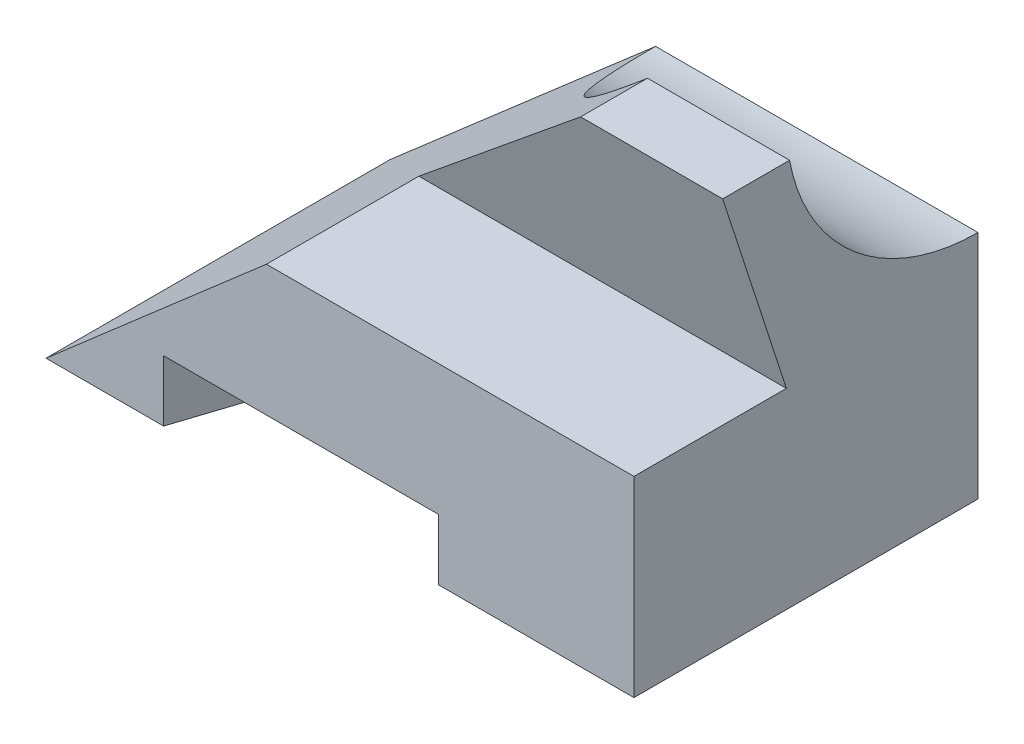
ISO-10303-21;
HEADER;
FILE_DESCRIPTION(('STEP AP214'),'2;1');
FILE_NAME('part.step','',(''),(''),'','','');
FILE_SCHEMA(('AUTOMOTIVE_DESIGN { 1 0 10303 214 1 1 1 1 }'));
ENDSEC;
DATA;
#1=APPLICATION_CONTEXT('core data for automotive mechanical design processes');
#2=APPLICATION_PROTOCOL_DEFINITION('international standard','automotive_design',2000,#1);
#3=PRODUCT_CONTEXT('',#1,'mechanical');
#4=PRODUCT('Part','Part','',(#3));
#5=PRODUCT_RELATED_PRODUCT_CATEGORY('part','',(#4));
#6=PRODUCT_DEFINITION_FORMATION('','',#4);
#7=PRODUCT_DEFINITION_CONTEXT('part definition',#1,'design');
#8=PRODUCT_DEFINITION('design','',#6,#7);
#9=PRODUCT_DEFINITION_SHAPE('','',#8);
#10=(LENGTH_UNIT() NAMED_UNIT(*) SI_UNIT(.MILLI.,.METRE.));
#11=(NAMED_UNIT(*) PLANE_ANGLE_UNIT() SI_UNIT($,.RADIAN.));
#12=(NAMED_UNIT(*) SI_UNIT($,.STERADIAN.) SOLID_ANGLE_UNIT());
#13=UNCERTAINTY_MEASURE_WITH_UNIT(LENGTH_MEASURE(1.E-05),#10,'distance_accuracy_value','');
#14=(GEOMETRIC_REPRESENTATION_CONTEXT(3) GLOBAL_UNCERTAINTY_ASSIGNED_CONTEXT((#13)) GLOBAL_UNIT_ASSIGNED_CONTEXT((#10,
#11,#12)) REPRESENTATION_CONTEXT('',''));
#15=CARTESIAN_POINT('',(0.,0.,0.));
#16=DIRECTION('',(0.,0.,1.));
#17=DIRECTION('',(1.,0.,0.));
#18=AXIS2_PLACEMENT_3D('',#15,#16,#17);
#19=CARTESIAN_POINT('',(0.,0.,0.));
#20=DIRECTION('',(0.,-1.,0.));
#21=DIRECTION('',(0.,0.,-1.));
#22=AXIS2_PLACEMENT_3D('',#19,#20,#21);
#23=PLANE('',#22);
#24=DIRECTION('',(-0.309016994374945,0.,0.951056516295154));
#25=VECTOR('',#24,1.);
#26=CARTESIAN_POINT('',(90.087733454296,0.,0.));
#27=LINE('',#26,#25);
#28=CARTESIAN_POINT('',(115.756389456695,0.,-79.));
#29=VERTEX_POINT('',#28);
#30=CARTESIAN_POINT('',(90.087733454296,0.,0.));
#31=VERTEX_POINT('',#30);
#32=EDGE_CURVE('E136',#29,#31,#27,.T.);
#33=ORIENTED_EDGE('',*,*,#32,.F.);
#34=DIRECTION('',(-1.,0.,0.));
#35=VECTOR('',#34,1.);
#36=CARTESIAN_POINT('',(0.,0.,-79.));
#37=LINE('',#36,#35);
#38=CARTESIAN_POINT('',(135.,0.,-79.));
#39=VERTEX_POINT('',#38);
#40=EDGE_CURVE('E185',#39,#29,#37,.T.);
#41=ORIENTED_EDGE('',*,*,#40,.F.);
#42=DIRECTION('',(0.,0.,-1.));
#43=VECTOR('',#42,1.);
#44=CARTESIAN_POINT('',(135.,0.,0.));
#45=LINE('',#44,#43);
#46=CARTESIAN_POINT('',(135.,0.,0.));
#47=VERTEX_POINT('',#46);
#48=EDGE_CURVE('E189',#47,#39,#45,.T.);
#49=ORIENTED_EDGE('',*,*,#48,.F.);
#50=DIRECTION('',(1.,0.,0.));
#51=VECTOR('',#50,1.);
#52=CARTESIAN_POINT('',(0.,0.,0.));
#53=LINE('',#52,#51);
#54=EDGE_CURVE('E187',#31,#47,#53,.T.);
#55=ORIENTED_EDGE('',*,*,#54,.F.);
#56=EDGE_LOOP('',(#33,#41,#49,#55));
#57=FACE_BOUND('',#56,.T.);
#58=ADVANCED_FACE('F39',(#57),#23,.T.);
#59=CARTESIAN_POINT('',(0.,89.,0.));
#60=DIRECTION('',(0.,0.,-1.));
#61=DIRECTION('',(-1.,0.,0.));
#62=AXIS2_PLACEMENT_3D('',#59,#60,#61);
#63=PLANE('',#62);
#64=DIRECTION('',(-1.,0.,0.));
#65=VECTOR('',#64,1.);
#66=CARTESIAN_POINT('',(27.,14.,0.));
#67=LINE('',#66,#65);
#68=CARTESIAN_POINT('',(90.087733454296,14.,0.));
#69=VERTEX_POINT('',#68);
#70=CARTESIAN_POINT('',(27.,14.,0.));
#71=VERTEX_POINT('',#70);
#72=EDGE_CURVE('E127',#69,#71,#67,.T.);
#73=ORIENTED_EDGE('',*,*,#72,.F.);
#74=DIRECTION('',(0.,-1.,0.));
#75=VECTOR('',#74,1.);
#76=CARTESIAN_POINT('',(90.087733454296,14.,0.));
#77=LINE('',#76,#75);
#78=EDGE_CURVE('E151',#69,#31,#77,.T.);
#79=ORIENTED_EDGE('',*,*,#78,.T.);
#80=ORIENTED_EDGE('',*,*,#54,.T.);
#81=DIRECTION('',(0.,-1.,0.));
#82=VECTOR('',#81,1.);
#83=CARTESIAN_POINT('',(135.,89.,0.));
#84=LINE('',#83,#82);
#85=CARTESIAN_POINT('',(135.,44.,0.));
#86=VERTEX_POINT('',#85);
#87=EDGE_CURVE('E47',#86,#47,#84,.T.);
#88=ORIENTED_EDGE('',*,*,#87,.F.);
#89=DIRECTION('',(1.,0.,0.));
#90=VECTOR('',#89,1.);
#91=CARTESIAN_POINT('',(0.,44.,0.));
#92=LINE('',#91,#90);
#93=CARTESIAN_POINT('',(50.6162099177242,44.,0.));
#94=VERTEX_POINT('',#93);
#95=EDGE_CURVE('E171',#94,#86,#92,.T.);
#96=ORIENTED_EDGE('',*,*,#95,.F.);
#97=DIRECTION('',(0.754709580222771,0.656059028990509,0.));
#98=VECTOR('',#97,1.);
#99=CARTESIAN_POINT('',(0.,0.,0.));
#100=LINE('',#99,#98);
#101=CARTESIAN_POINT('',(0.,0.,0.));
#102=VERTEX_POINT('',#101);
#103=EDGE_CURVE('E148',#102,#94,#100,.T.);
#104=ORIENTED_EDGE('',*,*,#103,.F.);
#105=CARTESIAN_POINT('',(27.,0.,0.));
#106=VERTEX_POINT('',#105);
#107=EDGE_CURVE('E141',#102,#106,#53,.T.);
#108=ORIENTED_EDGE('',*,*,#107,.T.);
#109=DIRECTION('',(0.,-1.,0.));
#110=VECTOR('',#109,1.);
#111=CARTESIAN_POINT('',(27.,14.,0.));
#112=LINE('',#111,#110);
#113=EDGE_CURVE('E54',#71,#106,#112,.T.);
#114=ORIENTED_EDGE('',*,*,#113,.F.);
#115=EDGE_LOOP('',(#73,#79,#80,#88,#96,#104,#108,#114));
#116=FACE_BOUND('',#115,.T.);
#117=ADVANCED_FACE('F41',(#116),#63,.F.);
#118=CARTESIAN_POINT('',(135.,89.,0.));
#119=DIRECTION('',(-1.,0.,0.));
#120=DIRECTION('',(0.,0.,1.));
#121=AXIS2_PLACEMENT_3D('',#118,#119,#120);
#122=PLANE('',#121);
#123=DIRECTION('',(0.,-1.,0.));
#124=VECTOR('',#123,1.);
#125=CARTESIAN_POINT('',(135.,89.,-79.));
#126=LINE('',#125,#124);
#127=CARTESIAN_POINT('',(135.,53.,-79.));
#128=VERTEX_POINT('',#127);
#129=EDGE_CURVE('E184',#128,#39,#126,.T.);
#130=ORIENTED_EDGE('',*,*,#129,.F.);
#131=CARTESIAN_POINT('',(135.,97.,-79.));
#132=DIRECTION('',(1.,0.,0.));
#133=DIRECTION('',(0.,0.,-1.));
#134=AXIS2_PLACEMENT_3D('',#131,#132,#133);
#135=CIRCLE('',#134,44.);
#136=CARTESIAN_POINT('',(135.,89.,-35.7333846944321));
#137=VERTEX_POINT('',#136);
#138=EDGE_CURVE('E162',#137,#128,#135,.T.);
#139=ORIENTED_EDGE('',*,*,#138,.F.);
#140=DIRECTION('',(0.,0.,-1.));
#141=VECTOR('',#140,1.);
#142=CARTESIAN_POINT('',(135.,89.,0.));
#143=LINE('',#142,#141);
#144=CARTESIAN_POINT('',(135.,89.,-20.378613669519));
#145=VERTEX_POINT('',#144);
#146=EDGE_CURVE('E181',#145,#137,#143,.T.);
#147=ORIENTED_EDGE('',*,*,#146,.F.);
#148=DIRECTION('',(0.,0.951056516295152,0.309016994374952));
#149=VECTOR('',#148,1.);
#150=CARTESIAN_POINT('',(135.,44.,-35.));
#151=LINE('',#150,#149);
#152=CARTESIAN_POINT('',(135.,44.,-35.));
#153=VERTEX_POINT('',#152);
#154=EDGE_CURVE('E173',#153,#145,#151,.T.);
#155=ORIENTED_EDGE('',*,*,#154,.F.);
#156=DIRECTION('',(0.,0.,-1.));
#157=VECTOR('',#156,1.);
#158=CARTESIAN_POINT('',(135.,44.,0.));
#159=LINE('',#158,#157);
#160=EDGE_CURVE('E166',#86,#153,#159,.T.);
#161=ORIENTED_EDGE('',*,*,#160,.F.);
#162=ORIENTED_EDGE('',*,*,#87,.T.);
#163=ORIENTED_EDGE('',*,*,#48,.T.);
#164=EDGE_LOOP('',(#130,#139,#147,#155,#161,#162,#163));
#165=FACE_BOUND('',#164,.T.);
#166=ADVANCED_FACE('F201',(#165),#122,.F.);
#167=CARTESIAN_POINT('',(0.,89.,-79.));
#168=DIRECTION('',(0.,0.,1.));
#169=DIRECTION('',(1.,0.,0.));
#170=AXIS2_PLACEMENT_3D('',#167,#168,#169);
#171=PLANE('',#170);
#172=ORIENTED_EDGE('',*,*,#40,.T.);
#173=DIRECTION('',(0.,-1.,0.));
#174=VECTOR('',#173,1.);
#175=CARTESIAN_POINT('',(115.756389456695,14.,-79.));
#176=LINE('',#175,#174);
#177=CARTESIAN_POINT('',(115.756389456695,14.,-79.));
#178=VERTEX_POINT('',#177);
#179=EDGE_CURVE('E143',#178,#29,#176,.T.);
#180=ORIENTED_EDGE('',*,*,#179,.F.);
#181=DIRECTION('',(1.,0.,0.));
#182=VECTOR('',#181,1.);
#183=CARTESIAN_POINT('',(52.6686560023994,14.,-79.));
#184=LINE('',#183,#182);
#185=CARTESIAN_POINT('',(52.6686560023994,14.,-79.));
#186=VERTEX_POINT('',#185);
#187=EDGE_CURVE('E126',#186,#178,#184,.T.);
#188=ORIENTED_EDGE('',*,*,#187,.F.);
#189=DIRECTION('',(0.,-1.,0.));
#190=VECTOR('',#189,1.);
#191=CARTESIAN_POINT('',(52.6686560023994,14.,-79.));
#192=LINE('',#191,#190);
#193=CARTESIAN_POINT('',(52.6686560023994,0.,-79.));
#194=VERTEX_POINT('',#193);
#195=EDGE_CURVE('E123',#186,#194,#192,.T.);
#196=ORIENTED_EDGE('',*,*,#195,.T.);
#197=CARTESIAN_POINT('',(0.,0.,-79.));
#198=VERTEX_POINT('',#197);
#199=EDGE_CURVE('E192',#194,#198,#37,.T.);
#200=ORIENTED_EDGE('',*,*,#199,.T.);
#201=DIRECTION('',(0.754709580222771,0.656059028990509,0.));
#202=VECTOR('',#201,1.);
#203=CARTESIAN_POINT('',(0.,0.,-79.));
#204=LINE('',#203,#202);
#205=CARTESIAN_POINT('',(60.9695255827133,53.,-79.));
#206=VERTEX_POINT('',#205);
#207=EDGE_CURVE('E150',#198,#206,#204,.T.);
#208=ORIENTED_EDGE('',*,*,#207,.T.);
#209=DIRECTION('',(1.,0.,0.));
#210=VECTOR('',#209,1.);
#211=CARTESIAN_POINT('',(0.,53.,-79.));
#212=LINE('',#211,#210);
#213=EDGE_CURVE('E165',#206,#128,#212,.T.);
#214=ORIENTED_EDGE('',*,*,#213,.T.);
#215=ORIENTED_EDGE('',*,*,#129,.T.);
#216=EDGE_LOOP('',(#172,#180,#188,#196,#200,#208,#214,#215));
#217=FACE_BOUND('',#216,.T.);
#218=ADVANCED_FACE('F210',(#217),#171,.F.);
#219=CARTESIAN_POINT('',(0.,89.,0.));
#220=DIRECTION('',(0.,-1.,0.));
#221=DIRECTION('',(0.,0.,-1.));
#222=AXIS2_PLACEMENT_3D('',#219,#220,#221);
#223=PLANE('',#222);
#224=DIRECTION('',(1.,0.,0.));
#225=VECTOR('',#224,1.);
#226=CARTESIAN_POINT('',(0.,89.,-35.7333846944321));
#227=LINE('',#226,#225);
#228=CARTESIAN_POINT('',(102.382788242669,89.,-35.7333846944321));
#229=VERTEX_POINT('',#228);
#230=EDGE_CURVE('E167',#229,#137,#227,.T.);
#231=ORIENTED_EDGE('',*,*,#230,.F.);
#232=DIRECTION('',(0.,0.,1.));
#233=VECTOR('',#232,1.);
#234=CARTESIAN_POINT('',(102.382788242669,89.,-79.));
#235=LINE('',#234,#233);
#236=CARTESIAN_POINT('',(102.382788242669,89.,-20.378613669519));
#237=VERTEX_POINT('',#236);
#238=EDGE_CURVE('E62',#229,#237,#235,.T.);
#239=ORIENTED_EDGE('',*,*,#238,.T.);
#240=DIRECTION('',(1.,0.,0.));
#241=VECTOR('',#240,1.);
#242=CARTESIAN_POINT('',(0.,89.,-20.378613669519));
#243=LINE('',#242,#241);
#244=EDGE_CURVE('E161',#237,#145,#243,.T.);
#245=ORIENTED_EDGE('',*,*,#244,.T.);
#246=ORIENTED_EDGE('',*,*,#146,.T.);
#247=EDGE_LOOP('',(#231,#239,#245,#246));
#248=FACE_BOUND('',#247,.T.);
#249=ADVANCED_FACE('F217',(#248),#223,.F.);
#250=DIRECTION('',(0.309016994374945,0.,-0.951056516295155));
#251=VECTOR('',#250,1.);
#252=CARTESIAN_POINT('',(27.,0.,0.));
#253=LINE('',#252,#251);
#254=EDGE_CURVE('E228',#106,#194,#253,.T.);
#255=ORIENTED_EDGE('',*,*,#254,.F.);
#256=ORIENTED_EDGE('',*,*,#107,.F.);
#257=DIRECTION('',(0.,0.,1.));
#258=VECTOR('',#257,1.);
#259=CARTESIAN_POINT('',(0.,0.,0.));
#260=LINE('',#259,#258);
#261=EDGE_CURVE('E169',#198,#102,#260,.T.);
#262=ORIENTED_EDGE('',*,*,#261,.F.);
#263=ORIENTED_EDGE('',*,*,#199,.F.);
#264=EDGE_LOOP('',(#255,#256,#262,#263));
#265=FACE_BOUND('',#264,.T.);
#266=ADVANCED_FACE('F226',(#265),#23,.T.);
#267=CARTESIAN_POINT('',(0.,44.,-35.));
#268=DIRECTION('',(0.,0.309016994374952,-0.951056516295152));
#269=DIRECTION('',(0.,0.951056516295152,0.309016994374952));
#270=AXIS2_PLACEMENT_3D('',#267,#268,#269);
#271=PLANE('',#270);
#272=ORIENTED_EDGE('',*,*,#244,.F.);
#273=DIRECTION('',(-0.738125680727814,-0.641642865098266,-0.208482404817743));
#274=VECTOR('',#273,1.);
#275=CARTESIAN_POINT('',(23.0390045361975,20.0275010958044,-42.789137061895));
#276=LINE('',#275,#274);
#277=CARTESIAN_POINT('',(50.6162099177242,44.,-35.));
#278=VERTEX_POINT('',#277);
#279=EDGE_CURVE('E158',#237,#278,#276,.T.);
#280=ORIENTED_EDGE('',*,*,#279,.T.);
#281=DIRECTION('',(1.,0.,0.));
#282=VECTOR('',#281,1.);
#283=CARTESIAN_POINT('',(0.,44.,-35.));
#284=LINE('',#283,#282);
#285=EDGE_CURVE('E174',#278,#153,#284,.T.);
#286=ORIENTED_EDGE('',*,*,#285,.T.);
#287=ORIENTED_EDGE('',*,*,#154,.T.);
#288=EDGE_LOOP('',(#272,#280,#286,#287));
#289=FACE_BOUND('',#288,.T.);
#290=ADVANCED_FACE('F220',(#289),#271,.F.);
#291=CARTESIAN_POINT('',(0.,44.,0.));
#292=DIRECTION('',(0.,-1.,0.));
#293=DIRECTION('',(0.,0.,-1.));
#294=AXIS2_PLACEMENT_3D('',#291,#292,#293);
#295=PLANE('',#294);
#296=ORIENTED_EDGE('',*,*,#285,.F.);
#297=DIRECTION('',(0.,0.,1.));
#298=VECTOR('',#297,1.);
#299=CARTESIAN_POINT('',(50.6162099177242,44.,0.));
#300=LINE('',#299,#298);
#301=EDGE_CURVE('E155',#278,#94,#300,.T.);
#302=ORIENTED_EDGE('',*,*,#301,.T.);
#303=ORIENTED_EDGE('',*,*,#95,.T.);
#304=ORIENTED_EDGE('',*,*,#160,.T.);
#305=EDGE_LOOP('',(#296,#302,#303,#304));
#306=FACE_BOUND('',#305,.T.);
#307=ADVANCED_FACE('F223',(#306),#295,.F.);
#308=CARTESIAN_POINT('',(0.,97.,-79.));
#309=DIRECTION('',(1.,0.,0.));
#310=DIRECTION('',(0.,0.,-1.));
#311=AXIS2_PLACEMENT_3D('',#308,#309,#310);
#312=CYLINDRICAL_SURFACE('',#311,44.);
#313=ORIENTED_EDGE('',*,*,#213,.F.);
#314=CARTESIAN_POINT('',(111.585735500438,97.,-79.));
#315=DIRECTION('',(0.656059028990509,-0.754709580222771,0.));
#316=DIRECTION('',(0.754709580222771,0.656059028990509,0.));
#317=AXIS2_PLACEMENT_3D('',#314,#315,#316);
#318=ELLIPSE('',#317,67.0671358150557,44.);
#319=EDGE_CURVE('E11',#206,#229,#318,.F.);
#320=ORIENTED_EDGE('',*,*,#319,.T.);
#321=ORIENTED_EDGE('',*,*,#230,.T.);
#322=ORIENTED_EDGE('',*,*,#138,.T.);
#323=EDGE_LOOP('',(#313,#320,#321,#322));
#324=FACE_BOUND('',#323,.T.);
#325=ADVANCED_FACE('F244',(#324),#312,.F.);
#326=CARTESIAN_POINT('',(0.,0.,-79.));
#327=DIRECTION('',(0.656059028990509,-0.754709580222771,0.));
#328=DIRECTION('',(0.754709580222771,0.656059028990509,0.));
#329=AXIS2_PLACEMENT_3D('',#326,#327,#328);
#330=PLANE('',#329);
#331=ORIENTED_EDGE('',*,*,#238,.F.);
#332=ORIENTED_EDGE('',*,*,#319,.F.);
#333=ORIENTED_EDGE('',*,*,#207,.F.);
#334=ORIENTED_EDGE('',*,*,#261,.T.);
#335=ORIENTED_EDGE('',*,*,#103,.T.);
#336=ORIENTED_EDGE('',*,*,#301,.F.);
#337=ORIENTED_EDGE('',*,*,#279,.F.);
#338=EDGE_LOOP('',(#331,#332,#333,#334,#335,#336,#337));
#339=FACE_BOUND('',#338,.T.);
#340=ADVANCED_FACE('F236',(#339),#330,.F.);
#341=CARTESIAN_POINT('',(90.087733454296,14.,0.));
#342=DIRECTION('',(0.951056516295154,0.,0.309016994374945));
#343=DIRECTION('',(0.309016994374945,0.,-0.951056516295155));
#344=AXIS2_PLACEMENT_3D('',#341,#342,#343);
#345=PLANE('',#344);
#346=ORIENTED_EDGE('',*,*,#32,.T.);
#347=ORIENTED_EDGE('',*,*,#78,.F.);
#348=DIRECTION('',(-0.309016994374945,0.,0.951056516295154));
#349=VECTOR('',#348,1.);
#350=CARTESIAN_POINT('',(90.087733454296,14.,0.));
#351=LINE('',#350,#349);
#352=EDGE_CURVE('E133',#178,#69,#351,.T.);
#353=ORIENTED_EDGE('',*,*,#352,.F.);
#354=ORIENTED_EDGE('',*,*,#179,.T.);
#355=EDGE_LOOP('',(#346,#347,#353,#354));
#356=FACE_BOUND('',#355,.T.);
#357=ADVANCED_FACE('F234',(#356),#345,.F.);
#358=CARTESIAN_POINT('',(27.,14.,0.));
#359=DIRECTION('',(-0.951056516295154,0.,-0.309016994374945));
#360=DIRECTION('',(-0.309016994374945,0.,0.951056516295155));
#361=AXIS2_PLACEMENT_3D('',#358,#359,#360);
#362=PLANE('',#361);
#363=ORIENTED_EDGE('',*,*,#254,.T.);
#364=ORIENTED_EDGE('',*,*,#195,.F.);
#365=DIRECTION('',(0.309016994374945,0.,-0.951056516295155));
#366=VECTOR('',#365,1.);
#367=CARTESIAN_POINT('',(27.,14.,0.));
#368=LINE('',#367,#366);
#369=EDGE_CURVE('E119',#71,#186,#368,.T.);
#370=ORIENTED_EDGE('',*,*,#369,.F.);
#371=ORIENTED_EDGE('',*,*,#113,.T.);
#372=EDGE_LOOP('',(#363,#364,#370,#371));
#373=FACE_BOUND('',#372,.T.);
#374=ADVANCED_FACE('F121',(#373),#362,.F.);
#375=CARTESIAN_POINT('',(0.,14.,0.));
#376=DIRECTION('',(0.,1.,0.));
#377=DIRECTION('',(0.,0.,1.));
#378=AXIS2_PLACEMENT_3D('',#375,#376,#377);
#379=PLANE('',#378);
#380=ORIENTED_EDGE('',*,*,#72,.T.);
#381=ORIENTED_EDGE('',*,*,#369,.T.);
#382=ORIENTED_EDGE('',*,*,#187,.T.);
#383=ORIENTED_EDGE('',*,*,#352,.T.);
#384=EDGE_LOOP('',(#380,#381,#382,#383));
#385=FACE_BOUND('',#384,.T.);
#386=ADVANCED_FACE('F131',(#385),#379,.F.);
#387=CLOSED_SHELL('',(#58,#117,#166,#218,#249,#266,#290,#307,#325,#340,#357,#374,#386));
#388=MANIFOLD_SOLID_BREP('B2',#387);
#389=ADVANCED_BREP_SHAPE_REPRESENTATION('',(#18,#388),#14);
#390=SHAPE_DEFINITION_REPRESENTATION(#9,#389);
ENDSEC;
END-ISO-10303-21;
